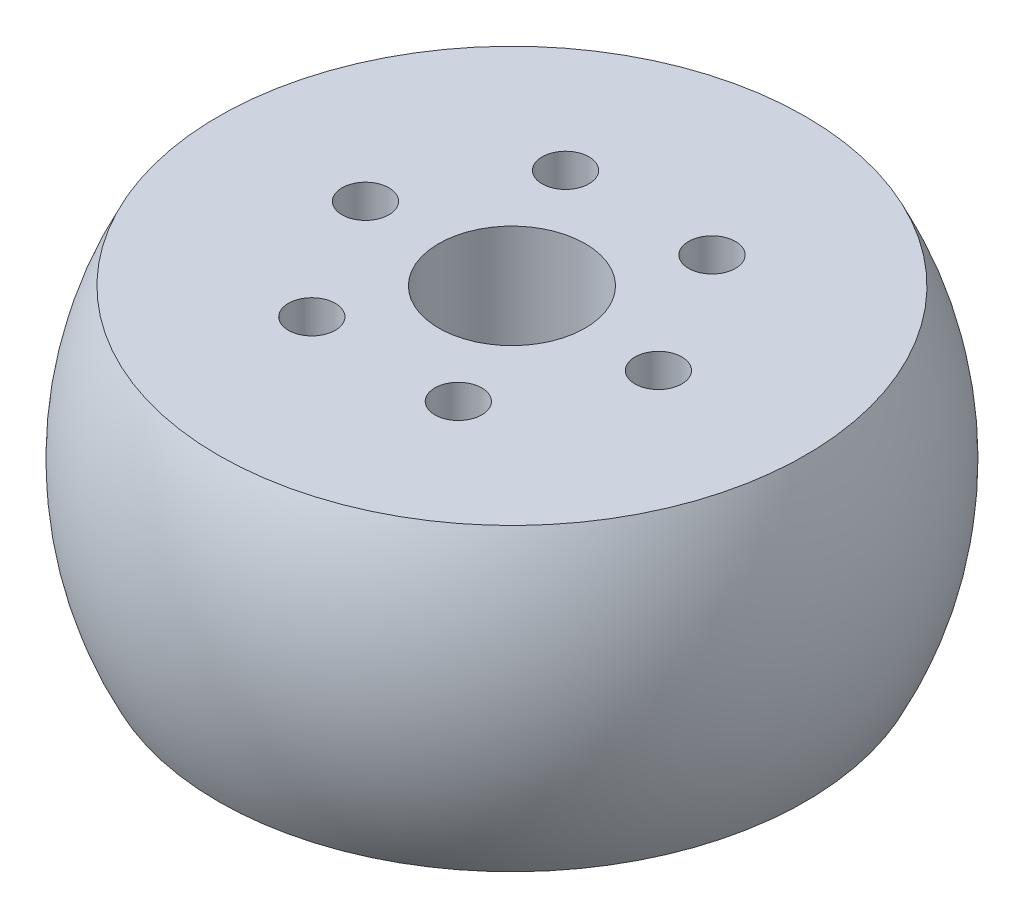
ISO-10303-21;
HEADER;
FILE_DESCRIPTION(('STEP AP214'),'2;1');
FILE_NAME('part.step','',(''),(''),'','','');
FILE_SCHEMA(('AUTOMOTIVE_DESIGN { 1 0 10303 214 1 1 1 1 }'));
ENDSEC;
DATA;
#1=APPLICATION_CONTEXT('core data for automotive mechanical design processes');
#2=APPLICATION_PROTOCOL_DEFINITION('international standard','automotive_design',2000,#1);
#3=PRODUCT_CONTEXT('',#1,'mechanical');
#4=PRODUCT('Part','Part','',(#3));
#5=PRODUCT_RELATED_PRODUCT_CATEGORY('part','',(#4));
#6=PRODUCT_DEFINITION_FORMATION('','',#4);
#7=PRODUCT_DEFINITION_CONTEXT('part definition',#1,'design');
#8=PRODUCT_DEFINITION('design','',#6,#7);
#9=PRODUCT_DEFINITION_SHAPE('','',#8);
#10=(LENGTH_UNIT() NAMED_UNIT(*) SI_UNIT(.MILLI.,.METRE.));
#11=(NAMED_UNIT(*) PLANE_ANGLE_UNIT() SI_UNIT($,.RADIAN.));
#12=(NAMED_UNIT(*) SI_UNIT($,.STERADIAN.) SOLID_ANGLE_UNIT());
#13=UNCERTAINTY_MEASURE_WITH_UNIT(LENGTH_MEASURE(1.E-05),#10,'distance_accuracy_value','');
#14=(GEOMETRIC_REPRESENTATION_CONTEXT(3) GLOBAL_UNCERTAINTY_ASSIGNED_CONTEXT((#13)) GLOBAL_UNIT_ASSIGNED_CONTEXT((#10,
#11,#12)) REPRESENTATION_CONTEXT('',''));
#15=CARTESIAN_POINT('',(0.,0.,0.));
#16=DIRECTION('',(0.,0.,1.));
#17=DIRECTION('',(1.,0.,0.));
#18=AXIS2_PLACEMENT_3D('',#15,#16,#17);
#19=CARTESIAN_POINT('',(0.,-6.5,0.));
#20=DIRECTION('',(0.,-1.,0.));
#21=DIRECTION('',(0.,0.,-1.));
#22=AXIS2_PLACEMENT_3D('',#19,#20,#21);
#23=CYLINDRICAL_SURFACE('',#22,3.175);
#24=CARTESIAN_POINT('',(0.,-6.5,0.));
#25=DIRECTION('',(0.,-1.,0.));
#26=DIRECTION('',(0.,0.,-1.));
#27=AXIS2_PLACEMENT_3D('',#24,#25,#26);
#28=CIRCLE('',#27,3.175);
#29=CARTESIAN_POINT('',(0.,-6.5,-3.175));
#30=VERTEX_POINT('',#29);
#31=EDGE_CURVE('E48',#30,#30,#28,.T.);
#32=ORIENTED_EDGE('',*,*,#31,.T.);
#33=EDGE_LOOP('',(#32));
#34=FACE_BOUND('',#33,.T.);
#35=CARTESIAN_POINT('',(0.,6.5,0.));
#36=DIRECTION('',(0.,-1.,0.));
#37=DIRECTION('',(0.,0.,-1.));
#38=AXIS2_PLACEMENT_3D('',#35,#36,#37);
#39=CIRCLE('',#38,3.175);
#40=CARTESIAN_POINT('',(0.,6.5,-3.175));
#41=VERTEX_POINT('',#40);
#42=EDGE_CURVE('E10',#41,#41,#39,.T.);
#43=ORIENTED_EDGE('',*,*,#42,.F.);
#44=EDGE_LOOP('',(#43));
#45=FACE_BOUND('',#44,.T.);
#46=ADVANCED_FACE('F34',(#34,#45),#23,.F.);
#47=CARTESIAN_POINT('',(0.,6.5,-3.175));
#48=DIRECTION('',(0.,1.,0.));
#49=DIRECTION('',(0.,0.,1.));
#50=AXIS2_PLACEMENT_3D('',#47,#48,#49);
#51=PLANE('',#50);
#52=CARTESIAN_POINT('',(3.17500000000007,6.5,5.49926131403115));
#53=DIRECTION('',(0.,1.,0.));
#54=DIRECTION('',(-0.866025403784433,0.,0.50000000000001));
#55=AXIS2_PLACEMENT_3D('',#52,#53,#54);
#56=CIRCLE('',#55,1.016);
#57=CARTESIAN_POINT('',(2.29511818975508,6.5,6.00726131403116));
#58=VERTEX_POINT('',#57);
#59=EDGE_CURVE('E70',#58,#58,#56,.T.);
#60=ORIENTED_EDGE('',*,*,#59,.F.);
#61=EDGE_LOOP('',(#60));
#62=FACE_BOUND('',#61,.T.);
#63=CARTESIAN_POINT('',(-3.17499999999995,6.50000000000001,5.49926131403122));
#64=DIRECTION('',(0.,1.,0.));
#65=DIRECTION('',(-0.866025403784443,0.,-0.499999999999992));
#66=AXIS2_PLACEMENT_3D('',#63,#64,#65);
#67=CIRCLE('',#66,1.016);
#68=CARTESIAN_POINT('',(-4.05488181024494,6.50000000000001,4.99126131403122));
#69=VERTEX_POINT('',#68);
#70=EDGE_CURVE('E69',#69,#69,#67,.T.);
#71=ORIENTED_EDGE('',*,*,#70,.F.);
#72=EDGE_LOOP('',(#71));
#73=FACE_BOUND('',#72,.T.);
#74=CARTESIAN_POINT('',(-6.35,6.50000000000001,0.));
#75=DIRECTION('',(0.,1.,0.));
#76=DIRECTION('',(0.,0.,-1.));
#77=AXIS2_PLACEMENT_3D('',#74,#75,#76);
#78=CIRCLE('',#77,1.016);
#79=CARTESIAN_POINT('',(-6.35,6.50000000000001,-1.016));
#80=VERTEX_POINT('',#79);
#81=EDGE_CURVE('E76',#80,#80,#78,.T.);
#82=ORIENTED_EDGE('',*,*,#81,.F.);
#83=EDGE_LOOP('',(#82));
#84=FACE_BOUND('',#83,.T.);
#85=CARTESIAN_POINT('',(-3.17500000000003,6.50000000000001,-5.49926131403117));
#86=DIRECTION('',(0.,1.,0.));
#87=DIRECTION('',(0.866025403784436,0.,-0.500000000000004));
#88=AXIS2_PLACEMENT_3D('',#85,#86,#87);
#89=CIRCLE('',#88,1.016);
#90=CARTESIAN_POINT('',(-2.29511818975504,6.50000000000001,-6.00726131403117));
#91=VERTEX_POINT('',#90);
#92=EDGE_CURVE('E82',#91,#91,#89,.T.);
#93=ORIENTED_EDGE('',*,*,#92,.F.);
#94=EDGE_LOOP('',(#93));
#95=FACE_BOUND('',#94,.T.);
#96=CARTESIAN_POINT('',(3.17499999999999,6.50000000000001,-5.49926131403119));
#97=DIRECTION('',(0.,1.,0.));
#98=DIRECTION('',(0.86602540378444,0.,0.499999999999998));
#99=AXIS2_PLACEMENT_3D('',#96,#97,#98);
#100=CIRCLE('',#99,1.016);
#101=CARTESIAN_POINT('',(4.05488181024498,6.50000000000001,-4.99126131403119));
#102=VERTEX_POINT('',#101);
#103=EDGE_CURVE('E62',#102,#102,#100,.T.);
#104=ORIENTED_EDGE('',*,*,#103,.F.);
#105=EDGE_LOOP('',(#104));
#106=FACE_BOUND('',#105,.T.);
#107=CARTESIAN_POINT('',(6.35,6.5,0.));
#108=DIRECTION('',(0.,1.,0.));
#109=DIRECTION('',(0.,0.,1.));
#110=AXIS2_PLACEMENT_3D('',#107,#108,#109);
#111=CIRCLE('',#110,1.016);
#112=CARTESIAN_POINT('',(6.35,6.5,1.016));
#113=VERTEX_POINT('',#112);
#114=EDGE_CURVE('E56',#113,#113,#111,.T.);
#115=ORIENTED_EDGE('',*,*,#114,.F.);
#116=EDGE_LOOP('',(#115));
#117=FACE_BOUND('',#116,.T.);
#118=ORIENTED_EDGE('',*,*,#42,.T.);
#119=EDGE_LOOP('',(#118));
#120=FACE_BOUND('',#119,.T.);
#121=CARTESIAN_POINT('',(0.,6.5,0.));
#122=DIRECTION('',(0.,-1.,0.));
#123=DIRECTION('',(0.,0.,-1.));
#124=AXIS2_PLACEMENT_3D('',#121,#122,#123);
#125=CIRCLE('',#124,12.7233115284504);
#126=CARTESIAN_POINT('',(0.,6.5,-12.7233115284504));
#127=VERTEX_POINT('',#126);
#128=EDGE_CURVE('E40',#127,#127,#125,.T.);
#129=ORIENTED_EDGE('',*,*,#128,.F.);
#130=EDGE_LOOP('',(#129));
#131=FACE_BOUND('',#130,.T.);
#132=ADVANCED_FACE('F92',(#62,#73,#84,#95,#106,#117,#120,#131),#51,.T.);
#133=CARTESIAN_POINT('',(0.,0.,0.));
#134=DIRECTION('',(0.,-1.,0.));
#135=DIRECTION('',(0.,0.,-1.));
#136=AXIS2_PLACEMENT_3D('',#133,#134,#135);
#137=SPHERICAL_SURFACE('',#136,14.2875);
#138=ORIENTED_EDGE('',*,*,#128,.T.);
#139=EDGE_LOOP('',(#138));
#140=FACE_BOUND('',#139,.T.);
#141=CARTESIAN_POINT('',(0.,-6.5,0.));
#142=DIRECTION('',(0.,-1.,0.));
#143=DIRECTION('',(0.,0.,-1.));
#144=AXIS2_PLACEMENT_3D('',#141,#142,#143);
#145=CIRCLE('',#144,12.7233115284504);
#146=CARTESIAN_POINT('',(0.,-6.49999999999999,-12.7233115284504));
#147=VERTEX_POINT('',#146);
#148=EDGE_CURVE('E44',#147,#147,#145,.T.);
#149=ORIENTED_EDGE('',*,*,#148,.F.);
#150=EDGE_LOOP('',(#149));
#151=FACE_BOUND('',#150,.T.);
#152=ADVANCED_FACE('F95',(#140,#151),#137,.T.);
#153=CARTESIAN_POINT('',(0.,-6.5,-3.175));
#154=DIRECTION('',(0.,-1.,0.));
#155=DIRECTION('',(0.,0.,-1.));
#156=AXIS2_PLACEMENT_3D('',#153,#154,#155);
#157=PLANE('',#156);
#158=CARTESIAN_POINT('',(3.17500000000006,-6.5,5.49926131403115));
#159=DIRECTION('',(0.,1.,0.));
#160=DIRECTION('',(-0.866025403784433,0.,0.50000000000001));
#161=AXIS2_PLACEMENT_3D('',#158,#159,#160);
#162=CIRCLE('',#161,1.016);
#163=CARTESIAN_POINT('',(2.29511818975508,-6.5,6.00726131403116));
#164=VERTEX_POINT('',#163);
#165=EDGE_CURVE('E66',#164,#164,#162,.T.);
#166=ORIENTED_EDGE('',*,*,#165,.T.);
#167=EDGE_LOOP('',(#166));
#168=FACE_BOUND('',#167,.T.);
#169=CARTESIAN_POINT('',(-3.17499999999995,-6.50000000000001,5.49926131403121));
#170=DIRECTION('',(0.,1.,0.));
#171=DIRECTION('',(-0.866025403784443,0.,-0.499999999999992));
#172=AXIS2_PLACEMENT_3D('',#169,#170,#171);
#173=CIRCLE('',#172,1.016);
#174=CARTESIAN_POINT('',(-4.05488181024494,-6.50000000000001,4.99126131403122));
#175=VERTEX_POINT('',#174);
#176=EDGE_CURVE('E73',#175,#175,#173,.T.);
#177=ORIENTED_EDGE('',*,*,#176,.T.);
#178=EDGE_LOOP('',(#177));
#179=FACE_BOUND('',#178,.T.);
#180=CARTESIAN_POINT('',(-6.35,-6.5,0.));
#181=DIRECTION('',(0.,1.,0.));
#182=DIRECTION('',(0.,0.,-1.));
#183=AXIS2_PLACEMENT_3D('',#180,#181,#182);
#184=CIRCLE('',#183,1.016);
#185=CARTESIAN_POINT('',(-6.35,-6.5,-1.016));
#186=VERTEX_POINT('',#185);
#187=EDGE_CURVE('E79',#186,#186,#184,.T.);
#188=ORIENTED_EDGE('',*,*,#187,.T.);
#189=EDGE_LOOP('',(#188));
#190=FACE_BOUND('',#189,.T.);
#191=CARTESIAN_POINT('',(-3.17500000000003,-6.5,-5.49926131403117));
#192=DIRECTION('',(0.,1.,0.));
#193=DIRECTION('',(0.866025403784436,0.,-0.500000000000004));
#194=AXIS2_PLACEMENT_3D('',#191,#192,#193);
#195=CIRCLE('',#194,1.016);
#196=CARTESIAN_POINT('',(-2.29511818975504,-6.5,-6.00726131403118));
#197=VERTEX_POINT('',#196);
#198=EDGE_CURVE('E65',#197,#197,#195,.T.);
#199=ORIENTED_EDGE('',*,*,#198,.T.);
#200=EDGE_LOOP('',(#199));
#201=FACE_BOUND('',#200,.T.);
#202=CARTESIAN_POINT('',(3.17499999999999,-6.5,-5.49926131403119));
#203=DIRECTION('',(0.,1.,0.));
#204=DIRECTION('',(0.86602540378444,0.,0.499999999999998));
#205=AXIS2_PLACEMENT_3D('',#202,#203,#204);
#206=CIRCLE('',#205,1.016);
#207=CARTESIAN_POINT('',(4.05488181024498,-6.5,-4.9912613140312));
#208=VERTEX_POINT('',#207);
#209=EDGE_CURVE('E59',#208,#208,#206,.T.);
#210=ORIENTED_EDGE('',*,*,#209,.T.);
#211=EDGE_LOOP('',(#210));
#212=FACE_BOUND('',#211,.T.);
#213=CARTESIAN_POINT('',(6.35,-6.5,0.));
#214=DIRECTION('',(0.,1.,0.));
#215=DIRECTION('',(0.,0.,1.));
#216=AXIS2_PLACEMENT_3D('',#213,#214,#215);
#217=CIRCLE('',#216,1.016);
#218=CARTESIAN_POINT('',(6.35,-6.5,1.016));
#219=VERTEX_POINT('',#218);
#220=EDGE_CURVE('E53',#219,#219,#217,.T.);
#221=ORIENTED_EDGE('',*,*,#220,.T.);
#222=EDGE_LOOP('',(#221));
#223=FACE_BOUND('',#222,.T.);
#224=ORIENTED_EDGE('',*,*,#148,.T.);
#225=EDGE_LOOP('',(#224));
#226=FACE_BOUND('',#225,.T.);
#227=ORIENTED_EDGE('',*,*,#31,.F.);
#228=EDGE_LOOP('',(#227));
#229=FACE_BOUND('',#228,.T.);
#230=ADVANCED_FACE('F105',(#168,#179,#190,#201,#212,#223,#226,#229),#157,.T.);
#231=CARTESIAN_POINT('',(6.35,-6.5,0.));
#232=DIRECTION('',(0.,1.,0.));
#233=DIRECTION('',(0.,0.,1.));
#234=AXIS2_PLACEMENT_3D('',#231,#232,#233);
#235=CYLINDRICAL_SURFACE('',#234,1.016);
#236=ORIENTED_EDGE('',*,*,#220,.F.);
#237=EDGE_LOOP('',(#236));
#238=FACE_BOUND('',#237,.T.);
#239=ORIENTED_EDGE('',*,*,#114,.T.);
#240=EDGE_LOOP('',(#239));
#241=FACE_BOUND('',#240,.T.);
#242=ADVANCED_FACE('F102',(#238,#241),#235,.F.);
#243=CARTESIAN_POINT('',(3.17499999999999,-6.5,-5.49926131403119));
#244=DIRECTION('',(0.,1.,0.));
#245=DIRECTION('',(-1.,0.,0.));
#246=AXIS2_PLACEMENT_3D('',#243,#244,#245);
#247=CYLINDRICAL_SURFACE('',#246,1.016);
#248=ORIENTED_EDGE('',*,*,#209,.F.);
#249=EDGE_LOOP('',(#248));
#250=FACE_BOUND('',#249,.T.);
#251=ORIENTED_EDGE('',*,*,#103,.T.);
#252=EDGE_LOOP('',(#251));
#253=FACE_BOUND('',#252,.T.);
#254=ADVANCED_FACE('F104',(#250,#253),#247,.F.);
#255=CARTESIAN_POINT('',(-3.17500000000003,-6.5,-5.49926131403117));
#256=DIRECTION('',(0.,1.,0.));
#257=DIRECTION('',(0.,0.,1.));
#258=AXIS2_PLACEMENT_3D('',#255,#256,#257);
#259=CYLINDRICAL_SURFACE('',#258,1.016);
#260=ORIENTED_EDGE('',*,*,#198,.F.);
#261=EDGE_LOOP('',(#260));
#262=FACE_BOUND('',#261,.T.);
#263=ORIENTED_EDGE('',*,*,#92,.T.);
#264=EDGE_LOOP('',(#263));
#265=FACE_BOUND('',#264,.T.);
#266=ADVANCED_FACE('F90',(#262,#265),#259,.F.);
#267=CARTESIAN_POINT('',(-6.35,-6.5,0.));
#268=DIRECTION('',(0.,1.,0.));
#269=DIRECTION('',(0.,0.,1.));
#270=AXIS2_PLACEMENT_3D('',#267,#268,#269);
#271=CYLINDRICAL_SURFACE('',#270,1.016);
#272=ORIENTED_EDGE('',*,*,#187,.F.);
#273=EDGE_LOOP('',(#272));
#274=FACE_BOUND('',#273,.T.);
#275=ORIENTED_EDGE('',*,*,#81,.T.);
#276=EDGE_LOOP('',(#275));
#277=FACE_BOUND('',#276,.T.);
#278=ADVANCED_FACE('F154',(#274,#277),#271,.F.);
#279=CARTESIAN_POINT('',(-3.17499999999995,-6.50000000000001,5.49926131403121));
#280=DIRECTION('',(0.,1.,0.));
#281=DIRECTION('',(0.,0.,1.));
#282=AXIS2_PLACEMENT_3D('',#279,#280,#281);
#283=CYLINDRICAL_SURFACE('',#282,1.016);
#284=ORIENTED_EDGE('',*,*,#176,.F.);
#285=EDGE_LOOP('',(#284));
#286=FACE_BOUND('',#285,.T.);
#287=ORIENTED_EDGE('',*,*,#70,.T.);
#288=EDGE_LOOP('',(#287));
#289=FACE_BOUND('',#288,.T.);
#290=ADVANCED_FACE('F164',(#286,#289),#283,.F.);
#291=CARTESIAN_POINT('',(3.17500000000006,-6.5,5.49926131403115));
#292=DIRECTION('',(0.,1.,0.));
#293=DIRECTION('',(-1.,0.,0.));
#294=AXIS2_PLACEMENT_3D('',#291,#292,#293);
#295=CYLINDRICAL_SURFACE('',#294,1.016);
#296=ORIENTED_EDGE('',*,*,#165,.F.);
#297=EDGE_LOOP('',(#296));
#298=FACE_BOUND('',#297,.T.);
#299=ORIENTED_EDGE('',*,*,#59,.T.);
#300=EDGE_LOOP('',(#299));
#301=FACE_BOUND('',#300,.T.);
#302=ADVANCED_FACE('F174',(#298,#301),#295,.F.);
#303=CLOSED_SHELL('',(#46,#132,#152,#230,#242,#254,#266,#278,#290,#302));
#304=MANIFOLD_SOLID_BREP('B2',#303);
#305=ADVANCED_BREP_SHAPE_REPRESENTATION('',(#18,#304),#14);
#306=SHAPE_DEFINITION_REPRESENTATION(#9,#305);
ENDSEC;
END-ISO-10303-21;
